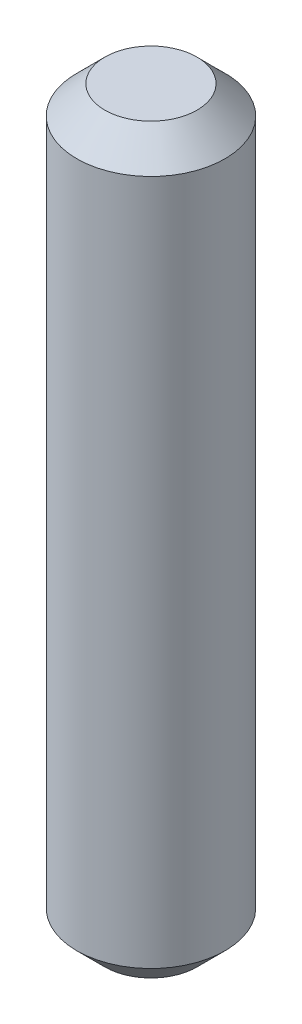
ISO-10303-21;
HEADER;
FILE_DESCRIPTION(('STEP AP214'),'2;1');
FILE_NAME('part.step','',(''),(''),'','','');
FILE_SCHEMA(('AUTOMOTIVE_DESIGN { 1 0 10303 214 1 1 1 1 }'));
ENDSEC;
DATA;
#1=APPLICATION_CONTEXT('core data for automotive mechanical design processes');
#2=APPLICATION_PROTOCOL_DEFINITION('international standard','automotive_design',2000,#1);
#3=PRODUCT_CONTEXT('',#1,'mechanical');
#4=PRODUCT('Part','Part','',(#3));
#5=PRODUCT_RELATED_PRODUCT_CATEGORY('part','',(#4));
#6=PRODUCT_DEFINITION_FORMATION('','',#4);
#7=PRODUCT_DEFINITION_CONTEXT('part definition',#1,'design');
#8=PRODUCT_DEFINITION('design','',#6,#7);
#9=PRODUCT_DEFINITION_SHAPE('','',#8);
#10=(LENGTH_UNIT() NAMED_UNIT(*) SI_UNIT(.MILLI.,.METRE.));
#11=(NAMED_UNIT(*) PLANE_ANGLE_UNIT() SI_UNIT($,.RADIAN.));
#12=(NAMED_UNIT(*) SI_UNIT($,.STERADIAN.) SOLID_ANGLE_UNIT());
#13=UNCERTAINTY_MEASURE_WITH_UNIT(LENGTH_MEASURE(1.E-05),#10,'distance_accuracy_value','');
#14=(GEOMETRIC_REPRESENTATION_CONTEXT(3) GLOBAL_UNCERTAINTY_ASSIGNED_CONTEXT((#13)) GLOBAL_UNIT_ASSIGNED_CONTEXT((#10,
#11,#12)) REPRESENTATION_CONTEXT('',''));
#15=CARTESIAN_POINT('',(0.,0.,0.));
#16=DIRECTION('',(0.,0.,1.));
#17=DIRECTION('',(1.,0.,0.));
#18=AXIS2_PLACEMENT_3D('',#15,#16,#17);
#19=CARTESIAN_POINT('',(0.,7.935,0.));
#20=DIRECTION('',(0.,-1.,0.));
#21=DIRECTION('',(0.,0.,-1.));
#22=AXIS2_PLACEMENT_3D('',#19,#20,#21);
#23=CYLINDRICAL_SURFACE('',#22,1.585);
#24=CARTESIAN_POINT('',(0.,-7.335,0.));
#25=DIRECTION('',(0.,1.,0.));
#26=DIRECTION('',(0.,0.,1.));
#27=AXIS2_PLACEMENT_3D('',#24,#25,#26);
#28=CIRCLE('',#27,1.585);
#29=CARTESIAN_POINT('',(0.,-7.335,1.585));
#30=VERTEX_POINT('',#29);
#31=EDGE_CURVE('E57',#30,#30,#28,.T.);
#32=ORIENTED_EDGE('',*,*,#31,.T.);
#33=EDGE_LOOP('',(#32));
#34=FACE_BOUND('',#33,.T.);
#35=CARTESIAN_POINT('',(0.,7.335,0.));
#36=DIRECTION('',(0.,1.,0.));
#37=DIRECTION('',(0.,0.,1.));
#38=AXIS2_PLACEMENT_3D('',#35,#36,#37);
#39=CIRCLE('',#38,1.585);
#40=CARTESIAN_POINT('',(0.,7.335,1.585));
#41=VERTEX_POINT('',#40);
#42=EDGE_CURVE('E62',#41,#41,#39,.F.);
#43=ORIENTED_EDGE('',*,*,#42,.T.);
#44=EDGE_LOOP('',(#43));
#45=FACE_BOUND('',#44,.T.);
#46=ADVANCED_FACE('F43',(#34,#45),#23,.T.);
#47=CARTESIAN_POINT('',(0.,7.935,0.));
#48=DIRECTION('',(0.,1.,0.));
#49=DIRECTION('',(0.,0.,1.));
#50=AXIS2_PLACEMENT_3D('',#47,#48,#49);
#51=PLANE('',#50);
#52=CARTESIAN_POINT('',(0.,7.935,0.));
#53=DIRECTION('',(0.,1.,0.));
#54=DIRECTION('',(0.,0.,1.));
#55=AXIS2_PLACEMENT_3D('',#52,#53,#54);
#56=CIRCLE('',#55,0.984999999999998);
#57=CARTESIAN_POINT('',(0.,7.935,0.984999999999998));
#58=VERTEX_POINT('',#57);
#59=EDGE_CURVE('E10',#58,#58,#56,.T.);
#60=ORIENTED_EDGE('',*,*,#59,.T.);
#61=EDGE_LOOP('',(#60));
#62=FACE_BOUND('',#61,.T.);
#63=ADVANCED_FACE('F79',(#62),#51,.T.);
#64=CARTESIAN_POINT('',(0.,-7.935,0.));
#65=DIRECTION('',(0.,1.,0.));
#66=DIRECTION('',(0.,0.,1.));
#67=AXIS2_PLACEMENT_3D('',#64,#65,#66);
#68=PLANE('',#67);
#69=CARTESIAN_POINT('',(0.,-7.935,0.));
#70=DIRECTION('',(0.,1.,0.));
#71=DIRECTION('',(0.,0.,1.));
#72=AXIS2_PLACEMENT_3D('',#69,#70,#71);
#73=CIRCLE('',#72,0.984999999999998);
#74=CARTESIAN_POINT('',(0.,-7.935,0.984999999999998));
#75=VERTEX_POINT('',#74);
#76=EDGE_CURVE('E52',#75,#75,#73,.F.);
#77=ORIENTED_EDGE('',*,*,#76,.T.);
#78=EDGE_LOOP('',(#77));
#79=FACE_BOUND('',#78,.T.);
#80=ADVANCED_FACE('F76',(#79),#68,.F.);
#81=CARTESIAN_POINT('',(0.,-7.335,0.));
#82=DIRECTION('',(0.,1.,0.));
#83=DIRECTION('',(0.,0.,1.));
#84=AXIS2_PLACEMENT_3D('',#81,#82,#83);
#85=CONICAL_SURFACE('',#84,1.585,0.785398163397449);
#86=ORIENTED_EDGE('',*,*,#76,.F.);
#87=EDGE_LOOP('',(#86));
#88=FACE_BOUND('',#87,.T.);
#89=ORIENTED_EDGE('',*,*,#31,.F.);
#90=EDGE_LOOP('',(#89));
#91=FACE_BOUND('',#90,.T.);
#92=ADVANCED_FACE('F72',(#88,#91),#85,.T.);
#93=CARTESIAN_POINT('',(0.,7.935,0.));
#94=DIRECTION('',(0.,-1.,0.));
#95=DIRECTION('',(0.,0.,-1.));
#96=AXIS2_PLACEMENT_3D('',#93,#94,#95);
#97=CONICAL_SURFACE('',#96,0.984999999999998,0.785398163397448);
#98=ORIENTED_EDGE('',*,*,#42,.F.);
#99=EDGE_LOOP('',(#98));
#100=FACE_BOUND('',#99,.T.);
#101=ORIENTED_EDGE('',*,*,#59,.F.);
#102=EDGE_LOOP('',(#101));
#103=FACE_BOUND('',#102,.T.);
#104=ADVANCED_FACE('F46',(#100,#103),#97,.T.);
#105=CLOSED_SHELL('',(#46,#63,#80,#92,#104));
#106=MANIFOLD_SOLID_BREP('B2',#105);
#107=ADVANCED_BREP_SHAPE_REPRESENTATION('',(#18,#106),#14);
#108=SHAPE_DEFINITION_REPRESENTATION(#9,#107);
ENDSEC;
END-ISO-10303-21;
